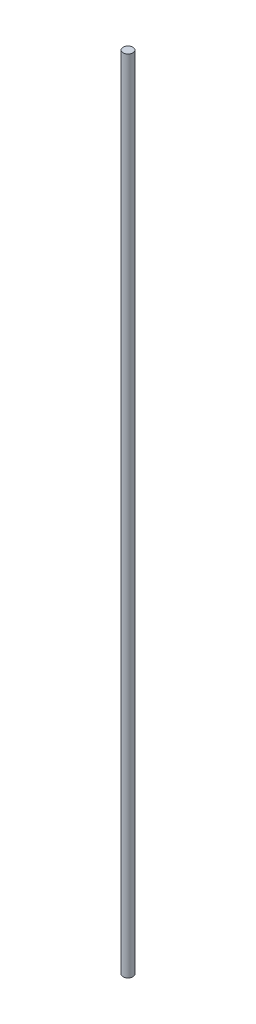
ISO-10303-21;
HEADER;
FILE_DESCRIPTION(('STEP AP214'),'2;1');
FILE_NAME('part.step','',(''),(''),'','','');
FILE_SCHEMA(('AUTOMOTIVE_DESIGN { 1 0 10303 214 1 1 1 1 }'));
ENDSEC;
DATA;
#1=APPLICATION_CONTEXT('core data for automotive mechanical design processes');
#2=APPLICATION_PROTOCOL_DEFINITION('international standard','automotive_design',2000,#1);
#3=PRODUCT_CONTEXT('',#1,'mechanical');
#4=PRODUCT('Part','Part','',(#3));
#5=PRODUCT_RELATED_PRODUCT_CATEGORY('part','',(#4));
#6=PRODUCT_DEFINITION_FORMATION('','',#4);
#7=PRODUCT_DEFINITION_CONTEXT('part definition',#1,'design');
#8=PRODUCT_DEFINITION('design','',#6,#7);
#9=PRODUCT_DEFINITION_SHAPE('','',#8);
#10=(LENGTH_UNIT() NAMED_UNIT(*) SI_UNIT(.MILLI.,.METRE.));
#11=(NAMED_UNIT(*) PLANE_ANGLE_UNIT() SI_UNIT($,.RADIAN.));
#12=(NAMED_UNIT(*) SI_UNIT($,.STERADIAN.) SOLID_ANGLE_UNIT());
#13=UNCERTAINTY_MEASURE_WITH_UNIT(LENGTH_MEASURE(1.E-05),#10,'distance_accuracy_value','');
#14=(GEOMETRIC_REPRESENTATION_CONTEXT(3) GLOBAL_UNCERTAINTY_ASSIGNED_CONTEXT((#13)) GLOBAL_UNIT_ASSIGNED_CONTEXT((#10,
#11,#12)) REPRESENTATION_CONTEXT('',''));
#15=CARTESIAN_POINT('',(0.,0.,0.));
#16=DIRECTION('',(0.,0.,1.));
#17=DIRECTION('',(1.,0.,0.));
#18=AXIS2_PLACEMENT_3D('',#15,#16,#17);
#19=CARTESIAN_POINT('',(0.,228.6,0.));
#20=DIRECTION('',(0.,-1.,0.));
#21=DIRECTION('',(0.,0.,-1.));
#22=AXIS2_PLACEMENT_3D('',#19,#20,#21);
#23=CYLINDRICAL_SURFACE('',#22,1.397);
#24=CARTESIAN_POINT('',(0.,228.6,0.));
#25=DIRECTION('',(0.,1.,0.));
#26=DIRECTION('',(0.,0.,1.));
#27=AXIS2_PLACEMENT_3D('',#24,#25,#26);
#28=CIRCLE('',#27,1.397);
#29=CARTESIAN_POINT('',(0.,228.6,1.397));
#30=VERTEX_POINT('',#29);
#31=EDGE_CURVE('E10',#30,#30,#28,.T.);
#32=ORIENTED_EDGE('',*,*,#31,.F.);
#33=EDGE_LOOP('',(#32));
#34=FACE_BOUND('',#33,.T.);
#35=CARTESIAN_POINT('',(0.,0.,0.));
#36=DIRECTION('',(0.,1.,0.));
#37=DIRECTION('',(0.,0.,1.));
#38=AXIS2_PLACEMENT_3D('',#35,#36,#37);
#39=CIRCLE('',#38,1.397);
#40=CARTESIAN_POINT('',(0.,0.,1.397));
#41=VERTEX_POINT('',#40);
#42=EDGE_CURVE('E31',#41,#41,#39,.T.);
#43=ORIENTED_EDGE('',*,*,#42,.T.);
#44=EDGE_LOOP('',(#43));
#45=FACE_BOUND('',#44,.T.);
#46=ADVANCED_FACE('F28',(#34,#45),#23,.T.);
#47=CARTESIAN_POINT('',(0.,228.6,0.));
#48=DIRECTION('',(0.,1.,0.));
#49=DIRECTION('',(0.,0.,1.));
#50=AXIS2_PLACEMENT_3D('',#47,#48,#49);
#51=PLANE('',#50);
#52=ORIENTED_EDGE('',*,*,#31,.T.);
#53=EDGE_LOOP('',(#52));
#54=FACE_BOUND('',#53,.T.);
#55=ADVANCED_FACE('F43',(#54),#51,.T.);
#56=CARTESIAN_POINT('',(0.,0.,0.));
#57=DIRECTION('',(0.,1.,0.));
#58=DIRECTION('',(0.,0.,1.));
#59=AXIS2_PLACEMENT_3D('',#56,#57,#58);
#60=PLANE('',#59);
#61=ORIENTED_EDGE('',*,*,#42,.F.);
#62=EDGE_LOOP('',(#61));
#63=FACE_BOUND('',#62,.T.);
#64=ADVANCED_FACE('F41',(#63),#60,.F.);
#65=CLOSED_SHELL('',(#46,#55,#64));
#66=MANIFOLD_SOLID_BREP('B2',#65);
#67=ADVANCED_BREP_SHAPE_REPRESENTATION('',(#18,#66),#14);
#68=SHAPE_DEFINITION_REPRESENTATION(#9,#67);
ENDSEC;
END-ISO-10303-21;
